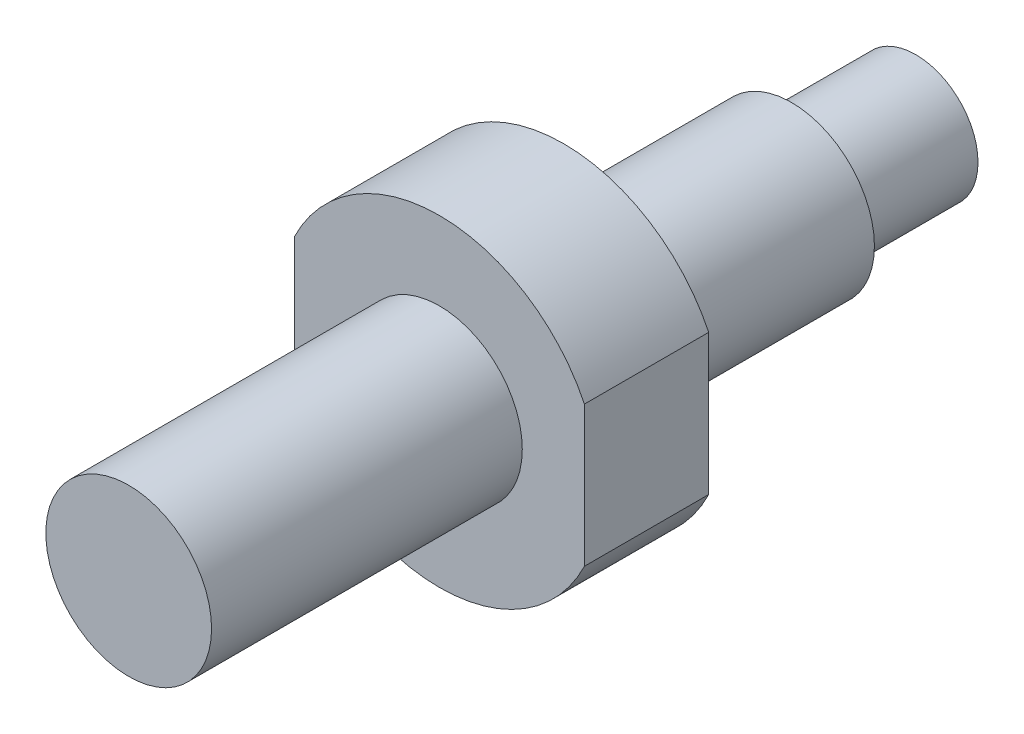
ISO-10303-21;
HEADER;
FILE_DESCRIPTION(('STEP AP214'),'2;1');
FILE_NAME('part.step','',(''),(''),'','','');
FILE_SCHEMA(('AUTOMOTIVE_DESIGN { 1 0 10303 214 1 1 1 1 }'));
ENDSEC;
DATA;
#1=APPLICATION_CONTEXT('core data for automotive mechanical design processes');
#2=APPLICATION_PROTOCOL_DEFINITION('international standard','automotive_design',2000,#1);
#3=PRODUCT_CONTEXT('',#1,'mechanical');
#4=PRODUCT('Part','Part','',(#3));
#5=PRODUCT_RELATED_PRODUCT_CATEGORY('part','',(#4));
#6=PRODUCT_DEFINITION_FORMATION('','',#4);
#7=PRODUCT_DEFINITION_CONTEXT('part definition',#1,'design');
#8=PRODUCT_DEFINITION('design','',#6,#7);
#9=PRODUCT_DEFINITION_SHAPE('','',#8);
#10=(LENGTH_UNIT() NAMED_UNIT(*) SI_UNIT(.MILLI.,.METRE.));
#11=(NAMED_UNIT(*) PLANE_ANGLE_UNIT() SI_UNIT($,.RADIAN.));
#12=(NAMED_UNIT(*) SI_UNIT($,.STERADIAN.) SOLID_ANGLE_UNIT());
#13=UNCERTAINTY_MEASURE_WITH_UNIT(LENGTH_MEASURE(1.E-05),#10,'distance_accuracy_value','');
#14=(GEOMETRIC_REPRESENTATION_CONTEXT(3) GLOBAL_UNCERTAINTY_ASSIGNED_CONTEXT((#13)) GLOBAL_UNIT_ASSIGNED_CONTEXT((#10,
#11,#12)) REPRESENTATION_CONTEXT('',''));
#15=CARTESIAN_POINT('',(0.,0.,0.));
#16=DIRECTION('',(0.,0.,1.));
#17=DIRECTION('',(1.,0.,0.));
#18=AXIS2_PLACEMENT_3D('',#15,#16,#17);
#19=CARTESIAN_POINT('',(0.,4.,-32.));
#20=DIRECTION('',(0.,0.,1.));
#21=DIRECTION('',(1.,0.,0.));
#22=AXIS2_PLACEMENT_3D('',#19,#20,#21);
#23=PLANE('',#22);
#24=CARTESIAN_POINT('',(0.,0.,-32.));
#25=DIRECTION('',(0.,0.,1.));
#26=DIRECTION('',(1.,0.,0.));
#27=AXIS2_PLACEMENT_3D('',#24,#25,#26);
#28=CIRCLE('',#27,4.);
#29=CARTESIAN_POINT('',(4.,0.,-32.));
#30=VERTEX_POINT('',#29);
#31=EDGE_CURVE('E124',#30,#30,#28,.T.);
#32=ORIENTED_EDGE('',*,*,#31,.F.);
#33=EDGE_LOOP('',(#32));
#34=FACE_BOUND('',#33,.T.);
#35=CARTESIAN_POINT('',(0.,0.,-32.));
#36=DIRECTION('',(0.,0.,1.));
#37=DIRECTION('',(1.,0.,0.));
#38=AXIS2_PLACEMENT_3D('',#35,#36,#37);
#39=CIRCLE('',#38,3.);
#40=CARTESIAN_POINT('',(3.,0.,-32.));
#41=VERTEX_POINT('',#40);
#42=EDGE_CURVE('E12',#41,#41,#39,.F.);
#43=ORIENTED_EDGE('',*,*,#42,.F.);
#44=EDGE_LOOP('',(#43));
#45=FACE_BOUND('',#44,.T.);
#46=ADVANCED_FACE('F39',(#34,#45),#23,.F.);
#47=CARTESIAN_POINT('',(0.,4.,-15.));
#48=DIRECTION('',(0.,0.,-1.));
#49=DIRECTION('',(-1.,0.,0.));
#50=AXIS2_PLACEMENT_3D('',#47,#48,#49);
#51=PLANE('',#50);
#52=CARTESIAN_POINT('',(0.,0.,-15.));
#53=DIRECTION('',(0.,0.,1.));
#54=DIRECTION('',(1.,0.,0.));
#55=AXIS2_PLACEMENT_3D('',#52,#53,#54);
#56=CIRCLE('',#55,4.);
#57=CARTESIAN_POINT('',(4.,0.,-15.));
#58=VERTEX_POINT('',#57);
#59=EDGE_CURVE('E105',#58,#58,#56,.T.);
#60=ORIENTED_EDGE('',*,*,#59,.F.);
#61=EDGE_LOOP('',(#60));
#62=FACE_BOUND('',#61,.T.);
#63=CARTESIAN_POINT('',(0.,0.,-15.));
#64=DIRECTION('',(0.,0.,-1.));
#65=DIRECTION('',(-1.,0.,0.));
#66=AXIS2_PLACEMENT_3D('',#63,#64,#65);
#67=CIRCLE('',#66,7.77784742024014);
#68=CARTESIAN_POINT('',(-7.,3.39041450158181,-15.));
#69=VERTEX_POINT('',#68);
#70=CARTESIAN_POINT('',(7.,3.39041450158181,-15.));
#71=VERTEX_POINT('',#70);
#72=EDGE_CURVE('E81',#69,#71,#67,.T.);
#73=ORIENTED_EDGE('',*,*,#72,.F.);
#74=DIRECTION('',(0.,1.,0.));
#75=VECTOR('',#74,1.);
#76=CARTESIAN_POINT('',(-7.,-8.43799237337698,-15.));
#77=LINE('',#76,#75);
#78=CARTESIAN_POINT('',(-7.,-3.39041450158181,-15.));
#79=VERTEX_POINT('',#78);
#80=EDGE_CURVE('E115',#79,#69,#77,.T.);
#81=ORIENTED_EDGE('',*,*,#80,.F.);
#82=CARTESIAN_POINT('',(7.,-3.39041450158181,-15.));
#83=VERTEX_POINT('',#82);
#84=EDGE_CURVE('E54',#83,#79,#67,.T.);
#85=ORIENTED_EDGE('',*,*,#84,.F.);
#86=DIRECTION('',(0.,-1.,0.));
#87=VECTOR('',#86,1.);
#88=CARTESIAN_POINT('',(7.,-8.43799237337698,-15.));
#89=LINE('',#88,#87);
#90=EDGE_CURVE('E118',#71,#83,#89,.T.);
#91=ORIENTED_EDGE('',*,*,#90,.F.);
#92=EDGE_LOOP('',(#73,#81,#85,#91));
#93=FACE_BOUND('',#92,.T.);
#94=ADVANCED_FACE('F117',(#62,#93),#51,.F.);
#95=CARTESIAN_POINT('',(0.,9.,-21.));
#96=DIRECTION('',(0.,0.,1.));
#97=DIRECTION('',(1.,0.,0.));
#98=AXIS2_PLACEMENT_3D('',#95,#96,#97);
#99=PLANE('',#98);
#100=CARTESIAN_POINT('',(0.,0.,-21.));
#101=DIRECTION('',(0.,0.,1.));
#102=DIRECTION('',(1.,0.,0.));
#103=AXIS2_PLACEMENT_3D('',#100,#101,#102);
#104=CIRCLE('',#103,4.);
#105=CARTESIAN_POINT('',(4.,0.,-21.));
#106=VERTEX_POINT('',#105);
#107=EDGE_CURVE('E127',#106,#106,#104,.T.);
#108=ORIENTED_EDGE('',*,*,#107,.T.);
#109=EDGE_LOOP('',(#108));
#110=FACE_BOUND('',#109,.T.);
#111=CARTESIAN_POINT('',(0.,0.,-21.));
#112=DIRECTION('',(0.,0.,-1.));
#113=DIRECTION('',(-1.,0.,0.));
#114=AXIS2_PLACEMENT_3D('',#111,#112,#113);
#115=CIRCLE('',#114,7.77784742024014);
#116=CARTESIAN_POINT('',(-7.,3.39041450158181,-21.));
#117=VERTEX_POINT('',#116);
#118=CARTESIAN_POINT('',(7.,3.39041450158181,-21.));
#119=VERTEX_POINT('',#118);
#120=EDGE_CURVE('E62',#117,#119,#115,.T.);
#121=ORIENTED_EDGE('',*,*,#120,.T.);
#122=DIRECTION('',(0.,-1.,0.));
#123=VECTOR('',#122,1.);
#124=CARTESIAN_POINT('',(7.,9.,-21.));
#125=LINE('',#124,#123);
#126=CARTESIAN_POINT('',(7.,-3.39041450158181,-21.));
#127=VERTEX_POINT('',#126);
#128=EDGE_CURVE('E92',#119,#127,#125,.T.);
#129=ORIENTED_EDGE('',*,*,#128,.T.);
#130=CARTESIAN_POINT('',(-7.,-3.39041450158181,-21.));
#131=VERTEX_POINT('',#130);
#132=EDGE_CURVE('E95',#127,#131,#115,.T.);
#133=ORIENTED_EDGE('',*,*,#132,.T.);
#134=DIRECTION('',(0.,1.,0.));
#135=VECTOR('',#134,1.);
#136=CARTESIAN_POINT('',(-7.,9.,-21.));
#137=LINE('',#136,#135);
#138=EDGE_CURVE('E94',#131,#117,#137,.T.);
#139=ORIENTED_EDGE('',*,*,#138,.T.);
#140=EDGE_LOOP('',(#121,#129,#133,#139));
#141=FACE_BOUND('',#140,.T.);
#142=ADVANCED_FACE('F90',(#110,#141),#99,.F.);
#143=CARTESIAN_POINT('',(7.,-8.43799237337698,-25.));
#144=DIRECTION('',(-1.,0.,0.));
#145=DIRECTION('',(0.,0.,1.));
#146=AXIS2_PLACEMENT_3D('',#143,#144,#145);
#147=PLANE('',#146);
#148=DIRECTION('',(0.,0.,-1.));
#149=VECTOR('',#148,1.);
#150=CARTESIAN_POINT('',(7.,3.39041450158181,-11.));
#151=LINE('',#150,#149);
#152=EDGE_CURVE('E78',#71,#119,#151,.T.);
#153=ORIENTED_EDGE('',*,*,#152,.F.);
#154=ORIENTED_EDGE('',*,*,#90,.T.);
#155=DIRECTION('',(0.,0.,-1.));
#156=VECTOR('',#155,1.);
#157=CARTESIAN_POINT('',(7.,-3.39041450158181,-11.));
#158=LINE('',#157,#156);
#159=EDGE_CURVE('E99',#127,#83,#158,.F.);
#160=ORIENTED_EDGE('',*,*,#159,.F.);
#161=ORIENTED_EDGE('',*,*,#128,.F.);
#162=EDGE_LOOP('',(#153,#154,#160,#161));
#163=FACE_BOUND('',#162,.T.);
#164=ADVANCED_FACE('F98',(#163),#147,.F.);
#165=CARTESIAN_POINT('',(-7.,-8.43799237337698,-25.));
#166=DIRECTION('',(1.,0.,0.));
#167=DIRECTION('',(0.,0.,-1.));
#168=AXIS2_PLACEMENT_3D('',#165,#166,#167);
#169=PLANE('',#168);
#170=DIRECTION('',(0.,0.,-1.));
#171=VECTOR('',#170,1.);
#172=CARTESIAN_POINT('',(-7.,-3.39041450158181,-11.));
#173=LINE('',#172,#171);
#174=EDGE_CURVE('E47',#79,#131,#173,.T.);
#175=ORIENTED_EDGE('',*,*,#174,.F.);
#176=ORIENTED_EDGE('',*,*,#80,.T.);
#177=DIRECTION('',(0.,0.,-1.));
#178=VECTOR('',#177,1.);
#179=CARTESIAN_POINT('',(-7.,3.39041450158181,-11.));
#180=LINE('',#179,#178);
#181=EDGE_CURVE('E102',#117,#69,#180,.F.);
#182=ORIENTED_EDGE('',*,*,#181,.F.);
#183=ORIENTED_EDGE('',*,*,#138,.F.);
#184=EDGE_LOOP('',(#175,#176,#182,#183));
#185=FACE_BOUND('',#184,.T.);
#186=ADVANCED_FACE('F114',(#185),#169,.F.);
#187=CARTESIAN_POINT('',(0.,0.,0.));
#188=DIRECTION('',(0.,0.,-1.));
#189=DIRECTION('',(-1.,0.,0.));
#190=AXIS2_PLACEMENT_3D('',#187,#188,#189);
#191=PLANE('',#190);
#192=CARTESIAN_POINT('',(0.,0.,0.));
#193=DIRECTION('',(0.,0.,1.));
#194=DIRECTION('',(1.,0.,0.));
#195=AXIS2_PLACEMENT_3D('',#192,#193,#194);
#196=CIRCLE('',#195,4.);
#197=CARTESIAN_POINT('',(4.,0.,0.));
#198=VERTEX_POINT('',#197);
#199=EDGE_CURVE('E100',#198,#198,#196,.T.);
#200=ORIENTED_EDGE('',*,*,#199,.T.);
#201=EDGE_LOOP('',(#200));
#202=FACE_BOUND('',#201,.T.);
#203=ADVANCED_FACE('F41',(#202),#191,.F.);
#204=CARTESIAN_POINT('',(0.,0.,0.));
#205=DIRECTION('',(0.,0.,1.));
#206=DIRECTION('',(1.,0.,0.));
#207=AXIS2_PLACEMENT_3D('',#204,#205,#206);
#208=CYLINDRICAL_SURFACE('',#207,4.);
#209=ORIENTED_EDGE('',*,*,#199,.F.);
#210=EDGE_LOOP('',(#209));
#211=FACE_BOUND('',#210,.T.);
#212=ORIENTED_EDGE('',*,*,#59,.T.);
#213=EDGE_LOOP('',(#212));
#214=FACE_BOUND('',#213,.T.);
#215=ADVANCED_FACE('F132',(#211,#214),#208,.T.);
#216=CARTESIAN_POINT('',(0.,0.,0.));
#217=DIRECTION('',(0.,0.,1.));
#218=DIRECTION('',(1.,0.,0.));
#219=AXIS2_PLACEMENT_3D('',#216,#217,#218);
#220=CYLINDRICAL_SURFACE('',#219,4.);
#221=ORIENTED_EDGE('',*,*,#107,.F.);
#222=EDGE_LOOP('',(#221));
#223=FACE_BOUND('',#222,.T.);
#224=ORIENTED_EDGE('',*,*,#31,.T.);
#225=EDGE_LOOP('',(#224));
#226=FACE_BOUND('',#225,.T.);
#227=ADVANCED_FACE('F146',(#223,#226),#220,.T.);
#228=CARTESIAN_POINT('',(0.,0.,-11.));
#229=DIRECTION('',(0.,0.,-1.));
#230=DIRECTION('',(-1.,0.,0.));
#231=AXIS2_PLACEMENT_3D('',#228,#229,#230);
#232=CYLINDRICAL_SURFACE('',#231,7.77784742024014);
#233=ORIENTED_EDGE('',*,*,#152,.T.);
#234=ORIENTED_EDGE('',*,*,#120,.F.);
#235=ORIENTED_EDGE('',*,*,#181,.T.);
#236=ORIENTED_EDGE('',*,*,#72,.T.);
#237=EDGE_LOOP('',(#233,#234,#235,#236));
#238=FACE_BOUND('',#237,.T.);
#239=ADVANCED_FACE('F79',(#238),#232,.T.);
#240=ORIENTED_EDGE('',*,*,#159,.T.);
#241=ORIENTED_EDGE('',*,*,#84,.T.);
#242=ORIENTED_EDGE('',*,*,#174,.T.);
#243=ORIENTED_EDGE('',*,*,#132,.F.);
#244=EDGE_LOOP('',(#240,#241,#242,#243));
#245=FACE_BOUND('',#244,.T.);
#246=ADVANCED_FACE('F109',(#245),#232,.T.);
#247=CARTESIAN_POINT('',(0.,0.,-38.));
#248=DIRECTION('',(0.,0.,1.));
#249=DIRECTION('',(1.,0.,0.));
#250=AXIS2_PLACEMENT_3D('',#247,#248,#249);
#251=CYLINDRICAL_SURFACE('',#250,3.);
#252=CARTESIAN_POINT('',(0.,0.,-38.));
#253=DIRECTION('',(0.,0.,-1.));
#254=DIRECTION('',(-1.,0.,0.));
#255=AXIS2_PLACEMENT_3D('',#252,#253,#254);
#256=CIRCLE('',#255,3.);
#257=CARTESIAN_POINT('',(-3.,0.,-38.));
#258=VERTEX_POINT('',#257);
#259=EDGE_CURVE('E113',#258,#258,#256,.T.);
#260=ORIENTED_EDGE('',*,*,#259,.F.);
#261=EDGE_LOOP('',(#260));
#262=FACE_BOUND('',#261,.T.);
#263=ORIENTED_EDGE('',*,*,#42,.T.);
#264=EDGE_LOOP('',(#263));
#265=FACE_BOUND('',#264,.T.);
#266=ADVANCED_FACE('F166',(#262,#265),#251,.T.);
#267=CARTESIAN_POINT('',(0.,0.,-38.));
#268=DIRECTION('',(0.,0.,-1.));
#269=DIRECTION('',(-1.,0.,0.));
#270=AXIS2_PLACEMENT_3D('',#267,#268,#269);
#271=PLANE('',#270);
#272=ORIENTED_EDGE('',*,*,#259,.T.);
#273=EDGE_LOOP('',(#272));
#274=FACE_BOUND('',#273,.T.);
#275=ADVANCED_FACE('F169',(#274),#271,.T.);
#276=CLOSED_SHELL('',(#46,#94,#142,#164,#186,#203,#215,#227,#239,#246,#266,#275));
#277=MANIFOLD_SOLID_BREP('B2',#276);
#278=ADVANCED_BREP_SHAPE_REPRESENTATION('',(#18,#277),#14);
#279=SHAPE_DEFINITION_REPRESENTATION(#9,#278);
ENDSEC;
END-ISO-10303-21;
